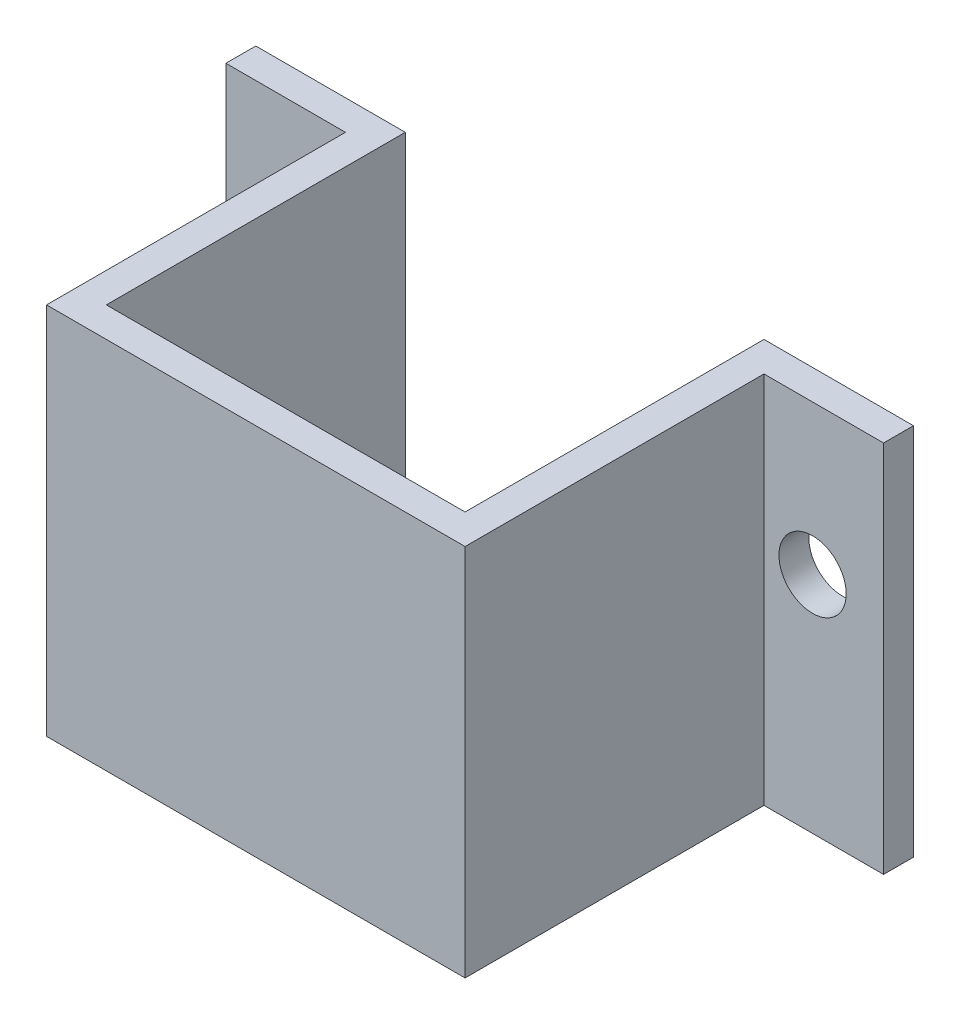
ISO-10303-21;
HEADER;
FILE_DESCRIPTION(('STEP AP214'),'2;1');
FILE_NAME('part.step','',(''),(''),'','','');
FILE_SCHEMA(('AUTOMOTIVE_DESIGN { 1 0 10303 214 1 1 1 1 }'));
ENDSEC;
DATA;
#1=APPLICATION_CONTEXT('core data for automotive mechanical design processes');
#2=APPLICATION_PROTOCOL_DEFINITION('international standard','automotive_design',2000,#1);
#3=PRODUCT_CONTEXT('',#1,'mechanical');
#4=PRODUCT('Part','Part','',(#3));
#5=PRODUCT_RELATED_PRODUCT_CATEGORY('part','',(#4));
#6=PRODUCT_DEFINITION_FORMATION('','',#4);
#7=PRODUCT_DEFINITION_CONTEXT('part definition',#1,'design');
#8=PRODUCT_DEFINITION('design','',#6,#7);
#9=PRODUCT_DEFINITION_SHAPE('','',#8);
#10=(LENGTH_UNIT() NAMED_UNIT(*) SI_UNIT(.MILLI.,.METRE.));
#11=(NAMED_UNIT(*) PLANE_ANGLE_UNIT() SI_UNIT($,.RADIAN.));
#12=(NAMED_UNIT(*) SI_UNIT($,.STERADIAN.) SOLID_ANGLE_UNIT());
#13=UNCERTAINTY_MEASURE_WITH_UNIT(LENGTH_MEASURE(1.E-05),#10,'distance_accuracy_value','');
#14=(GEOMETRIC_REPRESENTATION_CONTEXT(3) GLOBAL_UNCERTAINTY_ASSIGNED_CONTEXT((#13)) GLOBAL_UNIT_ASSIGNED_CONTEXT((#10,
#11,#12)) REPRESENTATION_CONTEXT('',''));
#15=CARTESIAN_POINT('',(0.,0.,0.));
#16=DIRECTION('',(0.,0.,1.));
#17=DIRECTION('',(1.,0.,0.));
#18=AXIS2_PLACEMENT_3D('',#15,#16,#17);
#19=CARTESIAN_POINT('',(-10.0285139082482,7.13093353409391,11.));
#20=DIRECTION('',(1.,0.,0.));
#21=DIRECTION('',(0.,1.,0.));
#22=AXIS2_PLACEMENT_3D('',#19,#20,#21);
#23=PLANE('',#22);
#24=DIRECTION('',(0.,1.,0.));
#25=VECTOR('',#24,1.);
#26=CARTESIAN_POINT('',(-10.0285139082482,7.13093353409391,1.));
#27=LINE('',#26,#25);
#28=CARTESIAN_POINT('',(-10.0285139082482,-5.36906646590609,1.));
#29=VERTEX_POINT('',#28);
#30=CARTESIAN_POINT('',(-10.0285139082482,7.13093353409391,1.));
#31=VERTEX_POINT('',#30);
#32=EDGE_CURVE('E46',#29,#31,#27,.T.);
#33=ORIENTED_EDGE('',*,*,#32,.F.);
#34=DIRECTION('',(0.,0.,-1.));
#35=VECTOR('',#34,1.);
#36=CARTESIAN_POINT('',(-10.0285139082482,-5.36906646590609,11.));
#37=LINE('',#36,#35);
#38=CARTESIAN_POINT('',(-10.0285139082482,-5.36906646590609,11.));
#39=VERTEX_POINT('',#38);
#40=EDGE_CURVE('E11',#39,#29,#37,.T.);
#41=ORIENTED_EDGE('',*,*,#40,.F.);
#42=DIRECTION('',(0.,-1.,0.));
#43=VECTOR('',#42,1.);
#44=CARTESIAN_POINT('',(-10.0285139082482,7.13093353409391,11.));
#45=LINE('',#44,#43);
#46=CARTESIAN_POINT('',(-10.0285139082482,7.13093353409391,11.));
#47=VERTEX_POINT('',#46);
#48=EDGE_CURVE('E201',#47,#39,#45,.T.);
#49=ORIENTED_EDGE('',*,*,#48,.F.);
#50=DIRECTION('',(0.,0.,-1.));
#51=VECTOR('',#50,1.);
#52=CARTESIAN_POINT('',(-10.0285139082482,7.13093353409391,11.));
#53=LINE('',#52,#51);
#54=EDGE_CURVE('E210',#47,#31,#53,.T.);
#55=ORIENTED_EDGE('',*,*,#54,.T.);
#56=EDGE_LOOP('',(#33,#41,#49,#55));
#57=FACE_BOUND('',#56,.T.);
#58=ADVANCED_FACE('F32',(#57),#23,.F.);
#59=CARTESIAN_POINT('',(3.97148609175178,7.13093353409391,11.));
#60=DIRECTION('',(-1.,0.,0.));
#61=DIRECTION('',(0.,-1.,0.));
#62=AXIS2_PLACEMENT_3D('',#59,#60,#61);
#63=PLANE('',#62);
#64=DIRECTION('',(0.,-1.,0.));
#65=VECTOR('',#64,1.);
#66=CARTESIAN_POINT('',(3.97148609175178,7.13093353409391,1.));
#67=LINE('',#66,#65);
#68=CARTESIAN_POINT('',(3.97148609175178,7.13093353409391,0.999999999999999));
#69=VERTEX_POINT('',#68);
#70=CARTESIAN_POINT('',(3.97148609175178,-5.36906646590609,0.999999999999999));
#71=VERTEX_POINT('',#70);
#72=EDGE_CURVE('E53',#69,#71,#67,.T.);
#73=ORIENTED_EDGE('',*,*,#72,.F.);
#74=DIRECTION('',(0.,0.,-1.));
#75=VECTOR('',#74,1.);
#76=CARTESIAN_POINT('',(3.97148609175178,7.13093353409391,11.));
#77=LINE('',#76,#75);
#78=CARTESIAN_POINT('',(3.97148609175178,7.13093353409391,11.));
#79=VERTEX_POINT('',#78);
#80=EDGE_CURVE('E215',#79,#69,#77,.T.);
#81=ORIENTED_EDGE('',*,*,#80,.F.);
#82=DIRECTION('',(0.,1.,0.));
#83=VECTOR('',#82,1.);
#84=CARTESIAN_POINT('',(3.97148609175178,7.13093353409391,11.));
#85=LINE('',#84,#83);
#86=CARTESIAN_POINT('',(3.97148609175178,-5.36906646590609,11.));
#87=VERTEX_POINT('',#86);
#88=EDGE_CURVE('E207',#87,#79,#85,.T.);
#89=ORIENTED_EDGE('',*,*,#88,.F.);
#90=DIRECTION('',(0.,0.,-1.));
#91=VECTOR('',#90,1.);
#92=CARTESIAN_POINT('',(3.97148609175178,-5.36906646590609,11.));
#93=LINE('',#92,#91);
#94=EDGE_CURVE('E39',#87,#71,#93,.T.);
#95=ORIENTED_EDGE('',*,*,#94,.T.);
#96=EDGE_LOOP('',(#73,#81,#89,#95));
#97=FACE_BOUND('',#96,.T.);
#98=ADVANCED_FACE('F218',(#97),#63,.F.);
#99=CARTESIAN_POINT('',(0.,0.,0.));
#100=DIRECTION('',(0.,0.,1.));
#101=DIRECTION('',(1.,0.,0.));
#102=AXIS2_PLACEMENT_3D('',#99,#100,#101);
#103=PLANE('',#102);
#104=CARTESIAN_POINT('',(-11.6535139082482,2.13093353409391,0.));
#105=DIRECTION('',(0.,0.,1.));
#106=DIRECTION('',(1.,0.,0.));
#107=AXIS2_PLACEMENT_3D('',#104,#105,#106);
#108=CIRCLE('',#107,1.125);
#109=CARTESIAN_POINT('',(-10.5285139082482,2.13093353409391,0.));
#110=VERTEX_POINT('',#109);
#111=EDGE_CURVE('E148',#110,#110,#108,.T.);
#112=ORIENTED_EDGE('',*,*,#111,.T.);
#113=EDGE_LOOP('',(#112));
#114=FACE_BOUND('',#113,.T.);
#115=DIRECTION('',(-1.,0.,0.));
#116=VECTOR('',#115,1.);
#117=CARTESIAN_POINT('',(-10.0285139082482,7.13093353409391,0.));
#118=LINE('',#117,#116);
#119=CARTESIAN_POINT('',(-9.02851390824822,7.13093353409391,0.));
#120=VERTEX_POINT('',#119);
#121=CARTESIAN_POINT('',(-14.0285139082482,7.13093353409391,0.));
#122=VERTEX_POINT('',#121);
#123=EDGE_CURVE('E131',#120,#122,#118,.T.);
#124=ORIENTED_EDGE('',*,*,#123,.F.);
#125=DIRECTION('',(0.,-1.,0.));
#126=VECTOR('',#125,1.);
#127=CARTESIAN_POINT('',(-9.02851390824822,7.13093353409391,0.));
#128=LINE('',#127,#126);
#129=CARTESIAN_POINT('',(-9.02851390824822,-5.36906646590609,0.));
#130=VERTEX_POINT('',#129);
#131=EDGE_CURVE('E128',#120,#130,#128,.T.);
#132=ORIENTED_EDGE('',*,*,#131,.T.);
#133=DIRECTION('',(1.,0.,0.));
#134=VECTOR('',#133,1.);
#135=CARTESIAN_POINT('',(-10.0285139082482,-5.36906646590609,0.));
#136=LINE('',#135,#134);
#137=CARTESIAN_POINT('',(-14.0285139082482,-5.36906646590609,0.));
#138=VERTEX_POINT('',#137);
#139=EDGE_CURVE('E122',#138,#130,#136,.T.);
#140=ORIENTED_EDGE('',*,*,#139,.F.);
#141=DIRECTION('',(0.,-1.,0.));
#142=VECTOR('',#141,1.);
#143=CARTESIAN_POINT('',(-14.0285139082482,7.13093353409391,0.));
#144=LINE('',#143,#142);
#145=EDGE_CURVE('E127',#122,#138,#144,.T.);
#146=ORIENTED_EDGE('',*,*,#145,.F.);
#147=EDGE_LOOP('',(#124,#132,#140,#146));
#148=FACE_BOUND('',#147,.T.);
#149=ADVANCED_FACE('F125',(#114,#148),#103,.F.);
#150=CARTESIAN_POINT('',(-10.0285139082482,-5.36906646590609,11.));
#151=DIRECTION('',(0.,1.,0.));
#152=DIRECTION('',(0.,0.,1.));
#153=AXIS2_PLACEMENT_3D('',#150,#151,#152);
#154=PLANE('',#153);
#155=ORIENTED_EDGE('',*,*,#139,.T.);
#156=DIRECTION('',(0.,0.,-1.));
#157=VECTOR('',#156,1.);
#158=CARTESIAN_POINT('',(-9.02851390824822,-5.36906646590609,0.));
#159=LINE('',#158,#157);
#160=CARTESIAN_POINT('',(-9.02851390824822,-5.36906646590609,10.));
#161=VERTEX_POINT('',#160);
#162=EDGE_CURVE('E177',#161,#130,#159,.T.);
#163=ORIENTED_EDGE('',*,*,#162,.F.);
#164=DIRECTION('',(-1.,0.,0.));
#165=VECTOR('',#164,1.);
#166=CARTESIAN_POINT('',(-9.02851390824822,-5.36906646590609,10.));
#167=LINE('',#166,#165);
#168=CARTESIAN_POINT('',(2.97148609175178,-5.36906646590609,10.));
#169=VERTEX_POINT('',#168);
#170=EDGE_CURVE('E182',#169,#161,#167,.T.);
#171=ORIENTED_EDGE('',*,*,#170,.F.);
#172=DIRECTION('',(0.,0.,1.));
#173=VECTOR('',#172,1.);
#174=CARTESIAN_POINT('',(2.97148609175178,-5.36906646590609,0.));
#175=LINE('',#174,#173);
#176=CARTESIAN_POINT('',(2.97148609175178,-5.36906646590609,0.));
#177=VERTEX_POINT('',#176);
#178=EDGE_CURVE('E189',#177,#169,#175,.T.);
#179=ORIENTED_EDGE('',*,*,#178,.F.);
#180=CARTESIAN_POINT('',(7.97148609175178,-5.36906646590609,0.));
#181=VERTEX_POINT('',#180);
#182=EDGE_CURVE('E132',#177,#181,#136,.T.);
#183=ORIENTED_EDGE('',*,*,#182,.T.);
#184=DIRECTION('',(0.,0.,-1.));
#185=VECTOR('',#184,1.);
#186=CARTESIAN_POINT('',(7.97148609175178,-5.36906646590609,0.));
#187=LINE('',#186,#185);
#188=CARTESIAN_POINT('',(7.97148609175178,-5.36906646590609,0.999999999999999));
#189=VERTEX_POINT('',#188);
#190=EDGE_CURVE('E167',#189,#181,#187,.T.);
#191=ORIENTED_EDGE('',*,*,#190,.F.);
#192=DIRECTION('',(-1.,0.,0.));
#193=VECTOR('',#192,1.);
#194=CARTESIAN_POINT('',(7.97148609175178,-5.36906646590609,0.999999999999999));
#195=LINE('',#194,#193);
#196=EDGE_CURVE('E170',#189,#71,#195,.T.);
#197=ORIENTED_EDGE('',*,*,#196,.T.);
#198=ORIENTED_EDGE('',*,*,#94,.F.);
#199=DIRECTION('',(1.,0.,0.));
#200=VECTOR('',#199,1.);
#201=CARTESIAN_POINT('',(-10.0285139082482,-5.36906646590609,11.));
#202=LINE('',#201,#200);
#203=EDGE_CURVE('E204',#39,#87,#202,.T.);
#204=ORIENTED_EDGE('',*,*,#203,.F.);
#205=ORIENTED_EDGE('',*,*,#40,.T.);
#206=DIRECTION('',(1.,0.,0.));
#207=VECTOR('',#206,1.);
#208=CARTESIAN_POINT('',(-14.0285139082482,-5.36906646590609,1.));
#209=LINE('',#208,#207);
#210=CARTESIAN_POINT('',(-14.0285139082482,-5.36906646590609,1.));
#211=VERTEX_POINT('',#210);
#212=EDGE_CURVE('E138',#211,#29,#209,.T.);
#213=ORIENTED_EDGE('',*,*,#212,.F.);
#214=DIRECTION('',(0.,0.,1.));
#215=VECTOR('',#214,1.);
#216=CARTESIAN_POINT('',(-14.0285139082482,-5.36906646590609,0.));
#217=LINE('',#216,#215);
#218=EDGE_CURVE('E135',#138,#211,#217,.T.);
#219=ORIENTED_EDGE('',*,*,#218,.F.);
#220=EDGE_LOOP('',(#155,#163,#171,#179,#183,#191,#197,#198,#204,#205,#213,#219));
#221=FACE_BOUND('',#220,.T.);
#222=ADVANCED_FACE('F136',(#221),#154,.F.);
#223=CARTESIAN_POINT('',(-10.0285139082482,7.13093353409391,11.));
#224=DIRECTION('',(0.,-1.,0.));
#225=DIRECTION('',(1.,0.,0.));
#226=AXIS2_PLACEMENT_3D('',#223,#224,#225);
#227=PLANE('',#226);
#228=DIRECTION('',(-1.,0.,0.));
#229=VECTOR('',#228,1.);
#230=CARTESIAN_POINT('',(-9.02851390824822,7.13093353409391,10.));
#231=LINE('',#230,#229);
#232=CARTESIAN_POINT('',(2.97148609175178,7.13093353409391,10.));
#233=VERTEX_POINT('',#232);
#234=CARTESIAN_POINT('',(-9.02851390824822,7.13093353409391,10.));
#235=VERTEX_POINT('',#234);
#236=EDGE_CURVE('E185',#233,#235,#231,.T.);
#237=ORIENTED_EDGE('',*,*,#236,.T.);
#238=DIRECTION('',(0.,0.,-1.));
#239=VECTOR('',#238,1.);
#240=CARTESIAN_POINT('',(-9.02851390824822,7.13093353409391,0.));
#241=LINE('',#240,#239);
#242=EDGE_CURVE('E178',#235,#120,#241,.T.);
#243=ORIENTED_EDGE('',*,*,#242,.T.);
#244=ORIENTED_EDGE('',*,*,#123,.T.);
#245=DIRECTION('',(0.,0.,-1.));
#246=VECTOR('',#245,1.);
#247=CARTESIAN_POINT('',(-14.0285139082482,7.13093353409391,0.));
#248=LINE('',#247,#246);
#249=CARTESIAN_POINT('',(-14.0285139082482,7.13093353409391,1.));
#250=VERTEX_POINT('',#249);
#251=EDGE_CURVE('E146',#250,#122,#248,.T.);
#252=ORIENTED_EDGE('',*,*,#251,.F.);
#253=DIRECTION('',(1.,0.,0.));
#254=VECTOR('',#253,1.);
#255=CARTESIAN_POINT('',(-14.0285139082482,7.13093353409391,1.));
#256=LINE('',#255,#254);
#257=EDGE_CURVE('E155',#250,#31,#256,.T.);
#258=ORIENTED_EDGE('',*,*,#257,.T.);
#259=ORIENTED_EDGE('',*,*,#54,.F.);
#260=DIRECTION('',(-1.,0.,0.));
#261=VECTOR('',#260,1.);
#262=CARTESIAN_POINT('',(-10.0285139082482,7.13093353409391,11.));
#263=LINE('',#262,#261);
#264=EDGE_CURVE('E209',#79,#47,#263,.T.);
#265=ORIENTED_EDGE('',*,*,#264,.F.);
#266=ORIENTED_EDGE('',*,*,#80,.T.);
#267=DIRECTION('',(-1.,0.,0.));
#268=VECTOR('',#267,1.);
#269=CARTESIAN_POINT('',(7.97148609175178,7.13093353409391,1.));
#270=LINE('',#269,#268);
#271=CARTESIAN_POINT('',(7.97148609175178,7.13093353409391,1.));
#272=VERTEX_POINT('',#271);
#273=EDGE_CURVE('E174',#272,#69,#270,.T.);
#274=ORIENTED_EDGE('',*,*,#273,.F.);
#275=DIRECTION('',(0.,0.,1.));
#276=VECTOR('',#275,1.);
#277=CARTESIAN_POINT('',(7.97148609175178,7.13093353409391,0.));
#278=LINE('',#277,#276);
#279=CARTESIAN_POINT('',(7.97148609175178,7.13093353409391,0.));
#280=VERTEX_POINT('',#279);
#281=EDGE_CURVE('E163',#280,#272,#278,.T.);
#282=ORIENTED_EDGE('',*,*,#281,.F.);
#283=CARTESIAN_POINT('',(2.97148609175178,7.13093353409391,0.));
#284=VERTEX_POINT('',#283);
#285=EDGE_CURVE('E205',#280,#284,#118,.T.);
#286=ORIENTED_EDGE('',*,*,#285,.T.);
#287=DIRECTION('',(0.,0.,1.));
#288=VECTOR('',#287,1.);
#289=CARTESIAN_POINT('',(2.97148609175178,7.13093353409391,0.));
#290=LINE('',#289,#288);
#291=EDGE_CURVE('E181',#284,#233,#290,.T.);
#292=ORIENTED_EDGE('',*,*,#291,.T.);
#293=EDGE_LOOP('',(#237,#243,#244,#252,#258,#259,#265,#266,#274,#282,#286,#292));
#294=FACE_BOUND('',#293,.T.);
#295=ADVANCED_FACE('F235',(#294),#227,.F.);
#296=CARTESIAN_POINT('',(0.,0.,11.));
#297=DIRECTION('',(0.,0.,1.));
#298=DIRECTION('',(1.,0.,0.));
#299=AXIS2_PLACEMENT_3D('',#296,#297,#298);
#300=PLANE('',#299);
#301=ORIENTED_EDGE('',*,*,#48,.T.);
#302=ORIENTED_EDGE('',*,*,#203,.T.);
#303=ORIENTED_EDGE('',*,*,#88,.T.);
#304=ORIENTED_EDGE('',*,*,#264,.T.);
#305=EDGE_LOOP('',(#301,#302,#303,#304));
#306=FACE_BOUND('',#305,.T.);
#307=ADVANCED_FACE('F240',(#306),#300,.T.);
#308=CARTESIAN_POINT('',(5.59648609175178,2.13093353409391,0.));
#309=DIRECTION('',(0.,0.,1.));
#310=DIRECTION('',(1.,0.,0.));
#311=AXIS2_PLACEMENT_3D('',#308,#309,#310);
#312=CIRCLE('',#311,1.125);
#313=CARTESIAN_POINT('',(6.72148609175178,2.13093353409391,0.));
#314=VERTEX_POINT('',#313);
#315=EDGE_CURVE('E387',#314,#314,#312,.T.);
#316=ORIENTED_EDGE('',*,*,#315,.T.);
#317=EDGE_LOOP('',(#316));
#318=FACE_BOUND('',#317,.T.);
#319=ORIENTED_EDGE('',*,*,#182,.F.);
#320=DIRECTION('',(0.,-1.,0.));
#321=VECTOR('',#320,1.);
#322=CARTESIAN_POINT('',(2.97148609175178,7.13093353409391,0.));
#323=LINE('',#322,#321);
#324=EDGE_CURVE('E198',#284,#177,#323,.T.);
#325=ORIENTED_EDGE('',*,*,#324,.F.);
#326=ORIENTED_EDGE('',*,*,#285,.F.);
#327=DIRECTION('',(0.,1.,0.));
#328=VECTOR('',#327,1.);
#329=CARTESIAN_POINT('',(7.97148609175178,7.13093353409391,0.));
#330=LINE('',#329,#328);
#331=EDGE_CURVE('E160',#181,#280,#330,.T.);
#332=ORIENTED_EDGE('',*,*,#331,.F.);
#333=EDGE_LOOP('',(#319,#325,#326,#332));
#334=FACE_BOUND('',#333,.T.);
#335=ADVANCED_FACE('F231',(#318,#334),#103,.F.);
#336=CARTESIAN_POINT('',(-9.02851390824822,7.13093353409391,0.));
#337=DIRECTION('',(-1.,0.,0.));
#338=DIRECTION('',(0.,0.,1.));
#339=AXIS2_PLACEMENT_3D('',#336,#337,#338);
#340=PLANE('',#339);
#341=ORIENTED_EDGE('',*,*,#162,.T.);
#342=ORIENTED_EDGE('',*,*,#131,.F.);
#343=ORIENTED_EDGE('',*,*,#242,.F.);
#344=DIRECTION('',(0.,-1.,0.));
#345=VECTOR('',#344,1.);
#346=CARTESIAN_POINT('',(-9.02851390824822,7.13093353409391,10.));
#347=LINE('',#346,#345);
#348=EDGE_CURVE('E194',#235,#161,#347,.T.);
#349=ORIENTED_EDGE('',*,*,#348,.T.);
#350=EDGE_LOOP('',(#341,#342,#343,#349));
#351=FACE_BOUND('',#350,.T.);
#352=ADVANCED_FACE('F247',(#351),#340,.F.);
#353=CARTESIAN_POINT('',(-9.02851390824822,7.13093353409391,10.));
#354=DIRECTION('',(0.,0.,1.));
#355=DIRECTION('',(1.,0.,0.));
#356=AXIS2_PLACEMENT_3D('',#353,#354,#355);
#357=PLANE('',#356);
#358=ORIENTED_EDGE('',*,*,#170,.T.);
#359=ORIENTED_EDGE('',*,*,#348,.F.);
#360=ORIENTED_EDGE('',*,*,#236,.F.);
#361=DIRECTION('',(0.,-1.,0.));
#362=VECTOR('',#361,1.);
#363=CARTESIAN_POINT('',(2.97148609175178,7.13093353409391,10.));
#364=LINE('',#363,#362);
#365=EDGE_CURVE('E196',#233,#169,#364,.T.);
#366=ORIENTED_EDGE('',*,*,#365,.T.);
#367=EDGE_LOOP('',(#358,#359,#360,#366));
#368=FACE_BOUND('',#367,.T.);
#369=ADVANCED_FACE('F250',(#368),#357,.F.);
#370=CARTESIAN_POINT('',(2.97148609175178,7.13093353409391,0.));
#371=DIRECTION('',(1.,0.,0.));
#372=DIRECTION('',(0.,0.,-1.));
#373=AXIS2_PLACEMENT_3D('',#370,#371,#372);
#374=PLANE('',#373);
#375=ORIENTED_EDGE('',*,*,#178,.T.);
#376=ORIENTED_EDGE('',*,*,#365,.F.);
#377=ORIENTED_EDGE('',*,*,#291,.F.);
#378=ORIENTED_EDGE('',*,*,#324,.T.);
#379=EDGE_LOOP('',(#375,#376,#377,#378));
#380=FACE_BOUND('',#379,.T.);
#381=ADVANCED_FACE('F252',(#380),#374,.F.);
#382=CARTESIAN_POINT('',(7.97148609175178,7.13093353409391,1.));
#383=DIRECTION('',(0.,0.,-1.));
#384=DIRECTION('',(0.,1.,0.));
#385=AXIS2_PLACEMENT_3D('',#382,#383,#384);
#386=PLANE('',#385);
#387=CARTESIAN_POINT('',(5.59648609175178,2.13093353409391,1.));
#388=DIRECTION('',(0.,0.,1.));
#389=DIRECTION('',(1.,0.,0.));
#390=AXIS2_PLACEMENT_3D('',#387,#388,#389);
#391=CIRCLE('',#390,1.125);
#392=CARTESIAN_POINT('',(6.72148609175178,2.13093353409391,1.));
#393=VERTEX_POINT('',#392);
#394=EDGE_CURVE('E151',#393,#393,#391,.T.);
#395=ORIENTED_EDGE('',*,*,#394,.F.);
#396=EDGE_LOOP('',(#395));
#397=FACE_BOUND('',#396,.T.);
#398=ORIENTED_EDGE('',*,*,#72,.T.);
#399=ORIENTED_EDGE('',*,*,#196,.F.);
#400=DIRECTION('',(0.,-1.,0.));
#401=VECTOR('',#400,1.);
#402=CARTESIAN_POINT('',(7.97148609175178,7.13093353409391,1.));
#403=LINE('',#402,#401);
#404=EDGE_CURVE('E165',#272,#189,#403,.T.);
#405=ORIENTED_EDGE('',*,*,#404,.F.);
#406=ORIENTED_EDGE('',*,*,#273,.T.);
#407=EDGE_LOOP('',(#398,#399,#405,#406));
#408=FACE_BOUND('',#407,.T.);
#409=ADVANCED_FACE('F221',(#397,#408),#386,.F.);
#410=CARTESIAN_POINT('',(7.97148609175178,0.,0.));
#411=DIRECTION('',(-1.,0.,0.));
#412=DIRECTION('',(0.,-1.,0.));
#413=AXIS2_PLACEMENT_3D('',#410,#411,#412);
#414=PLANE('',#413);
#415=ORIENTED_EDGE('',*,*,#331,.T.);
#416=ORIENTED_EDGE('',*,*,#281,.T.);
#417=ORIENTED_EDGE('',*,*,#404,.T.);
#418=ORIENTED_EDGE('',*,*,#190,.T.);
#419=EDGE_LOOP('',(#415,#416,#417,#418));
#420=FACE_BOUND('',#419,.T.);
#421=ADVANCED_FACE('F229',(#420),#414,.F.);
#422=CARTESIAN_POINT('',(-14.0285139082482,7.13093353409391,1.));
#423=DIRECTION('',(0.,0.,-1.));
#424=DIRECTION('',(0.,1.,0.));
#425=AXIS2_PLACEMENT_3D('',#422,#423,#424);
#426=PLANE('',#425);
#427=CARTESIAN_POINT('',(-11.6535139082482,2.13093353409391,1.));
#428=DIRECTION('',(0.,0.,1.));
#429=DIRECTION('',(1.,0.,0.));
#430=AXIS2_PLACEMENT_3D('',#427,#428,#429);
#431=CIRCLE('',#430,1.125);
#432=CARTESIAN_POINT('',(-10.5285139082482,2.13093353409391,1.));
#433=VERTEX_POINT('',#432);
#434=EDGE_CURVE('E390',#433,#433,#431,.T.);
#435=ORIENTED_EDGE('',*,*,#434,.F.);
#436=EDGE_LOOP('',(#435));
#437=FACE_BOUND('',#436,.T.);
#438=ORIENTED_EDGE('',*,*,#32,.T.);
#439=ORIENTED_EDGE('',*,*,#257,.F.);
#440=DIRECTION('',(0.,1.,0.));
#441=VECTOR('',#440,1.);
#442=CARTESIAN_POINT('',(-14.0285139082482,7.13093353409391,1.));
#443=LINE('',#442,#441);
#444=EDGE_CURVE('E141',#211,#250,#443,.T.);
#445=ORIENTED_EDGE('',*,*,#444,.F.);
#446=ORIENTED_EDGE('',*,*,#212,.T.);
#447=EDGE_LOOP('',(#438,#439,#445,#446));
#448=FACE_BOUND('',#447,.T.);
#449=ADVANCED_FACE('F242',(#437,#448),#426,.F.);
#450=CARTESIAN_POINT('',(-14.0285139082482,0.,0.));
#451=DIRECTION('',(-1.,0.,0.));
#452=DIRECTION('',(0.,-1.,0.));
#453=AXIS2_PLACEMENT_3D('',#450,#451,#452);
#454=PLANE('',#453);
#455=ORIENTED_EDGE('',*,*,#145,.T.);
#456=ORIENTED_EDGE('',*,*,#218,.T.);
#457=ORIENTED_EDGE('',*,*,#444,.T.);
#458=ORIENTED_EDGE('',*,*,#251,.T.);
#459=EDGE_LOOP('',(#455,#456,#457,#458));
#460=FACE_BOUND('',#459,.T.);
#461=ADVANCED_FACE('F144',(#460),#454,.T.);
#462=CARTESIAN_POINT('',(-11.6535139082482,2.13093353409391,0.));
#463=DIRECTION('',(0.,0.,1.));
#464=DIRECTION('',(1.,0.,0.));
#465=AXIS2_PLACEMENT_3D('',#462,#463,#464);
#466=CYLINDRICAL_SURFACE('',#465,1.125);
#467=ORIENTED_EDGE('',*,*,#111,.F.);
#468=EDGE_LOOP('',(#467));
#469=FACE_BOUND('',#468,.T.);
#470=ORIENTED_EDGE('',*,*,#434,.T.);
#471=EDGE_LOOP('',(#470));
#472=FACE_BOUND('',#471,.T.);
#473=ADVANCED_FACE('F338',(#469,#472),#466,.F.);
#474=CARTESIAN_POINT('',(5.59648609175178,2.13093353409391,0.));
#475=DIRECTION('',(0.,0.,1.));
#476=DIRECTION('',(1.,0.,0.));
#477=AXIS2_PLACEMENT_3D('',#474,#475,#476);
#478=CYLINDRICAL_SURFACE('',#477,1.125);
#479=ORIENTED_EDGE('',*,*,#315,.F.);
#480=EDGE_LOOP('',(#479));
#481=FACE_BOUND('',#480,.T.);
#482=ORIENTED_EDGE('',*,*,#394,.T.);
#483=EDGE_LOOP('',(#482));
#484=FACE_BOUND('',#483,.T.);
#485=ADVANCED_FACE('F370',(#481,#484),#478,.F.);
#486=CLOSED_SHELL('',(#58,#98,#149,#222,#295,#307,#335,#352,#369,#381,#409,#421,#449,#461,#473,#485));
#487=MANIFOLD_SOLID_BREP('B2',#486);
#488=ADVANCED_BREP_SHAPE_REPRESENTATION('',(#18,#487),#14);
#489=SHAPE_DEFINITION_REPRESENTATION(#9,#488);
ENDSEC;
END-ISO-10303-21;
